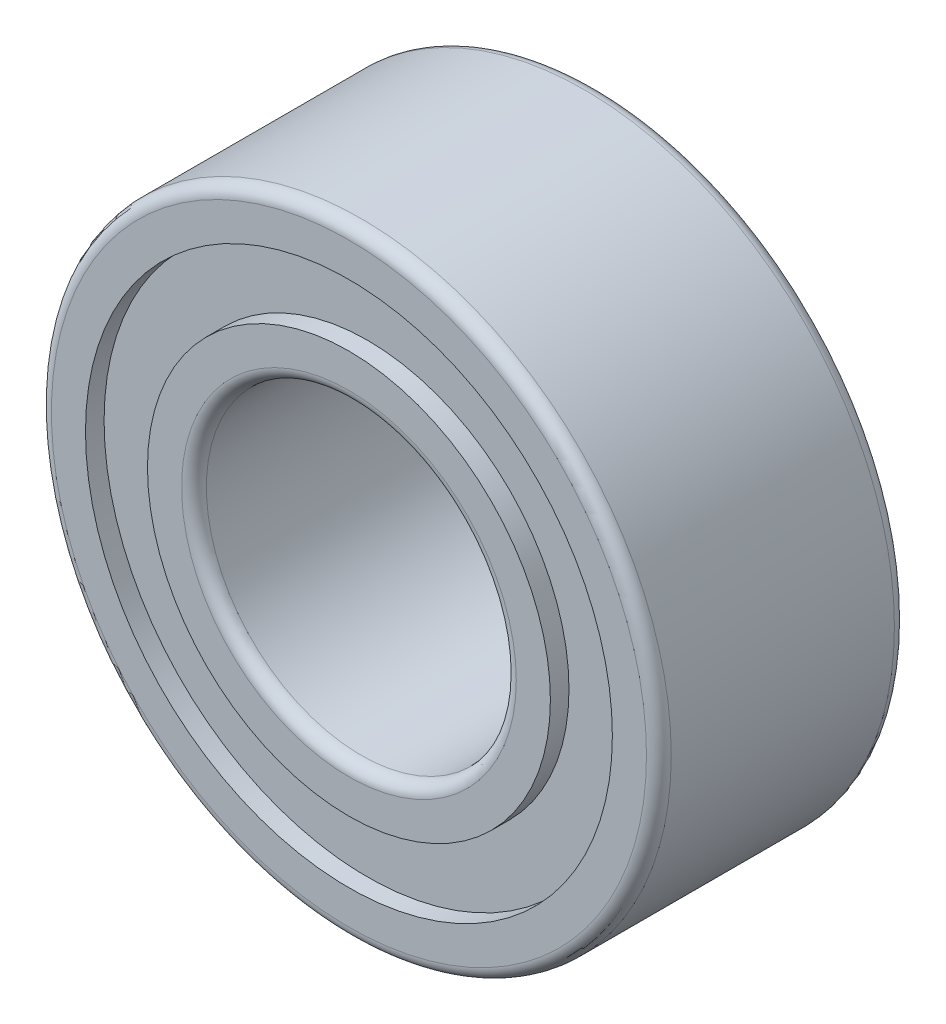
ISO-10303-21;
HEADER;
FILE_DESCRIPTION(('STEP AP214'),'2;1');
FILE_NAME('part.step','',(''),(''),'','','');
FILE_SCHEMA(('AUTOMOTIVE_DESIGN { 1 0 10303 214 1 1 1 1 }'));
ENDSEC;
DATA;
#1=APPLICATION_CONTEXT('core data for automotive mechanical design processes');
#2=APPLICATION_PROTOCOL_DEFINITION('international standard','automotive_design',2000,#1);
#3=PRODUCT_CONTEXT('',#1,'mechanical');
#4=PRODUCT('Part','Part','',(#3));
#5=PRODUCT_RELATED_PRODUCT_CATEGORY('part','',(#4));
#6=PRODUCT_DEFINITION_FORMATION('','',#4);
#7=PRODUCT_DEFINITION_CONTEXT('part definition',#1,'design');
#8=PRODUCT_DEFINITION('design','',#6,#7);
#9=PRODUCT_DEFINITION_SHAPE('','',#8);
#10=(LENGTH_UNIT() NAMED_UNIT(*) SI_UNIT(.MILLI.,.METRE.));
#11=(NAMED_UNIT(*) PLANE_ANGLE_UNIT() SI_UNIT($,.RADIAN.));
#12=(NAMED_UNIT(*) SI_UNIT($,.STERADIAN.) SOLID_ANGLE_UNIT());
#13=UNCERTAINTY_MEASURE_WITH_UNIT(LENGTH_MEASURE(1.E-05),#10,'distance_accuracy_value','');
#14=(GEOMETRIC_REPRESENTATION_CONTEXT(3) GLOBAL_UNCERTAINTY_ASSIGNED_CONTEXT((#13)) GLOBAL_UNIT_ASSIGNED_CONTEXT((#10,
#11,#12)) REPRESENTATION_CONTEXT('',''));
#15=CARTESIAN_POINT('',(0.,0.,0.));
#16=DIRECTION('',(0.,0.,1.));
#17=DIRECTION('',(1.,0.,0.));
#18=AXIS2_PLACEMENT_3D('',#15,#16,#17);
#19=CARTESIAN_POINT('',(0.,0.,0.));
#20=DIRECTION('',(0.,0.,1.));
#21=DIRECTION('',(1.,0.,0.));
#22=AXIS2_PLACEMENT_3D('',#19,#20,#21);
#23=PLANE('',#22);
#24=CARTESIAN_POINT('',(0.,0.,0.));
#25=DIRECTION('',(0.,0.,1.));
#26=DIRECTION('',(1.,0.,0.));
#27=AXIS2_PLACEMENT_3D('',#24,#25,#26);
#28=CIRCLE('',#27,2.7);
#29=CARTESIAN_POINT('',(2.7,0.,0.));
#30=VERTEX_POINT('',#29);
#31=EDGE_CURVE('E10',#30,#30,#28,.T.);
#32=ORIENTED_EDGE('',*,*,#31,.T.);
#33=EDGE_LOOP('',(#32));
#34=FACE_BOUND('',#33,.T.);
#35=CARTESIAN_POINT('',(0.,0.,0.));
#36=DIRECTION('',(0.,0.,-1.));
#37=DIRECTION('',(-1.,0.,0.));
#38=AXIS2_PLACEMENT_3D('',#35,#36,#37);
#39=CIRCLE('',#38,3.25);
#40=CARTESIAN_POINT('',(-3.25,0.,0.));
#41=VERTEX_POINT('',#40);
#42=EDGE_CURVE('E87',#41,#41,#39,.T.);
#43=ORIENTED_EDGE('',*,*,#42,.T.);
#44=EDGE_LOOP('',(#43));
#45=FACE_BOUND('',#44,.T.);
#46=ADVANCED_FACE('F36',(#34,#45),#23,.F.);
#47=CARTESIAN_POINT('',(0.,0.,4.));
#48=DIRECTION('',(0.,0.,1.));
#49=DIRECTION('',(1.,0.,0.));
#50=AXIS2_PLACEMENT_3D('',#47,#48,#49);
#51=PLANE('',#50);
#52=CARTESIAN_POINT('',(0.,0.,4.));
#53=DIRECTION('',(0.,0.,1.));
#54=DIRECTION('',(1.,0.,0.));
#55=AXIS2_PLACEMENT_3D('',#52,#53,#54);
#56=CIRCLE('',#55,2.7);
#57=CARTESIAN_POINT('',(2.7,0.,4.));
#58=VERTEX_POINT('',#57);
#59=EDGE_CURVE('E43',#58,#58,#56,.F.);
#60=ORIENTED_EDGE('',*,*,#59,.T.);
#61=EDGE_LOOP('',(#60));
#62=FACE_BOUND('',#61,.T.);
#63=CARTESIAN_POINT('',(0.,0.,4.));
#64=DIRECTION('',(0.,0.,1.));
#65=DIRECTION('',(1.,0.,0.));
#66=AXIS2_PLACEMENT_3D('',#63,#64,#65);
#67=CIRCLE('',#66,3.25);
#68=CARTESIAN_POINT('',(3.25,0.,4.));
#69=VERTEX_POINT('',#68);
#70=EDGE_CURVE('E73',#69,#69,#67,.T.);
#71=ORIENTED_EDGE('',*,*,#70,.T.);
#72=EDGE_LOOP('',(#71));
#73=FACE_BOUND('',#72,.T.);
#74=ADVANCED_FACE('F125',(#62,#73),#51,.T.);
#75=CARTESIAN_POINT('',(0.,0.,4.));
#76=DIRECTION('',(0.,0.,-1.));
#77=DIRECTION('',(-1.,0.,0.));
#78=AXIS2_PLACEMENT_3D('',#75,#76,#77);
#79=CYLINDRICAL_SURFACE('',#78,2.5);
#80=CARTESIAN_POINT('',(0.,0.,3.8));
#81=DIRECTION('',(0.,0.,1.));
#82=DIRECTION('',(1.,0.,0.));
#83=AXIS2_PLACEMENT_3D('',#80,#81,#82);
#84=CIRCLE('',#83,2.5);
#85=CARTESIAN_POINT('',(2.5,0.,3.8));
#86=VERTEX_POINT('',#85);
#87=EDGE_CURVE('E47',#86,#86,#84,.T.);
#88=ORIENTED_EDGE('',*,*,#87,.T.);
#89=EDGE_LOOP('',(#88));
#90=FACE_BOUND('',#89,.T.);
#91=CARTESIAN_POINT('',(0.,0.,0.2));
#92=DIRECTION('',(0.,0.,1.));
#93=DIRECTION('',(1.,0.,0.));
#94=AXIS2_PLACEMENT_3D('',#91,#92,#93);
#95=CIRCLE('',#94,2.5);
#96=CARTESIAN_POINT('',(2.5,0.,0.2));
#97=VERTEX_POINT('',#96);
#98=EDGE_CURVE('E51',#97,#97,#95,.F.);
#99=ORIENTED_EDGE('',*,*,#98,.T.);
#100=EDGE_LOOP('',(#99));
#101=FACE_BOUND('',#100,.T.);
#102=ADVANCED_FACE('F131',(#90,#101),#79,.F.);
#103=CARTESIAN_POINT('',(0.,0.,4.));
#104=DIRECTION('',(0.,0.,-1.));
#105=DIRECTION('',(-1.,0.,0.));
#106=AXIS2_PLACEMENT_3D('',#103,#104,#105);
#107=CYLINDRICAL_SURFACE('',#106,5.);
#108=CARTESIAN_POINT('',(0.,0.,3.8));
#109=DIRECTION('',(0.,0.,1.));
#110=DIRECTION('',(1.,0.,0.));
#111=AXIS2_PLACEMENT_3D('',#108,#109,#110);
#112=CIRCLE('',#111,5.);
#113=CARTESIAN_POINT('',(5.,0.,3.8));
#114=VERTEX_POINT('',#113);
#115=EDGE_CURVE('E59',#114,#114,#112,.F.);
#116=ORIENTED_EDGE('',*,*,#115,.T.);
#117=EDGE_LOOP('',(#116));
#118=FACE_BOUND('',#117,.T.);
#119=CARTESIAN_POINT('',(0.,0.,0.2));
#120=DIRECTION('',(0.,0.,1.));
#121=DIRECTION('',(1.,0.,0.));
#122=AXIS2_PLACEMENT_3D('',#119,#120,#121);
#123=CIRCLE('',#122,5.);
#124=CARTESIAN_POINT('',(5.,0.,0.2));
#125=VERTEX_POINT('',#124);
#126=EDGE_CURVE('E62',#125,#125,#123,.T.);
#127=ORIENTED_EDGE('',*,*,#126,.T.);
#128=EDGE_LOOP('',(#127));
#129=FACE_BOUND('',#128,.T.);
#130=ADVANCED_FACE('F122',(#118,#129),#107,.T.);
#131=CARTESIAN_POINT('',(0.,0.,4.));
#132=DIRECTION('',(0.,0.,1.));
#133=DIRECTION('',(1.,0.,0.));
#134=AXIS2_PLACEMENT_3D('',#131,#132,#133);
#135=CIRCLE('',#134,4.8);
#136=CARTESIAN_POINT('',(4.8,0.,4.));
#137=VERTEX_POINT('',#136);
#138=EDGE_CURVE('E65',#137,#137,#135,.T.);
#139=ORIENTED_EDGE('',*,*,#138,.T.);
#140=EDGE_LOOP('',(#139));
#141=FACE_BOUND('',#140,.T.);
#142=CARTESIAN_POINT('',(0.,0.,4.));
#143=DIRECTION('',(0.,0.,1.));
#144=DIRECTION('',(1.,0.,0.));
#145=AXIS2_PLACEMENT_3D('',#142,#143,#144);
#146=CIRCLE('',#145,4.25);
#147=CARTESIAN_POINT('',(4.25,0.,4.));
#148=VERTEX_POINT('',#147);
#149=EDGE_CURVE('E69',#148,#148,#146,.T.);
#150=ORIENTED_EDGE('',*,*,#149,.F.);
#151=EDGE_LOOP('',(#150));
#152=FACE_BOUND('',#151,.T.);
#153=ADVANCED_FACE('F112',(#141,#152),#51,.T.);
#154=CARTESIAN_POINT('',(0.,0.,0.));
#155=DIRECTION('',(0.,0.,1.));
#156=DIRECTION('',(1.,0.,0.));
#157=AXIS2_PLACEMENT_3D('',#154,#155,#156);
#158=CIRCLE('',#157,4.8);
#159=CARTESIAN_POINT('',(4.8,0.,0.));
#160=VERTEX_POINT('',#159);
#161=EDGE_CURVE('E56',#160,#160,#158,.F.);
#162=ORIENTED_EDGE('',*,*,#161,.T.);
#163=EDGE_LOOP('',(#162));
#164=FACE_BOUND('',#163,.T.);
#165=CARTESIAN_POINT('',(0.,0.,0.));
#166=DIRECTION('',(0.,0.,-1.));
#167=DIRECTION('',(-1.,0.,0.));
#168=AXIS2_PLACEMENT_3D('',#165,#166,#167);
#169=CIRCLE('',#168,4.25);
#170=CARTESIAN_POINT('',(-4.25,0.,0.));
#171=VERTEX_POINT('',#170);
#172=EDGE_CURVE('E81',#171,#171,#169,.T.);
#173=ORIENTED_EDGE('',*,*,#172,.F.);
#174=EDGE_LOOP('',(#173));
#175=FACE_BOUND('',#174,.T.);
#176=ADVANCED_FACE('F109',(#164,#175),#23,.F.);
#177=CARTESIAN_POINT('',(0.,0.,3.7));
#178=DIRECTION('',(0.,0.,1.));
#179=DIRECTION('',(1.,0.,0.));
#180=AXIS2_PLACEMENT_3D('',#177,#178,#179);
#181=CYLINDRICAL_SURFACE('',#180,3.25);
#182=CARTESIAN_POINT('',(0.,0.,3.7));
#183=DIRECTION('',(0.,0.,1.));
#184=DIRECTION('',(1.,0.,0.));
#185=AXIS2_PLACEMENT_3D('',#182,#183,#184);
#186=CIRCLE('',#185,3.25);
#187=CARTESIAN_POINT('',(3.25,0.,3.7));
#188=VERTEX_POINT('',#187);
#189=EDGE_CURVE('E72',#188,#188,#186,.T.);
#190=ORIENTED_EDGE('',*,*,#189,.T.);
#191=EDGE_LOOP('',(#190));
#192=FACE_BOUND('',#191,.T.);
#193=ORIENTED_EDGE('',*,*,#70,.F.);
#194=EDGE_LOOP('',(#193));
#195=FACE_BOUND('',#194,.T.);
#196=ADVANCED_FACE('F111',(#192,#195),#181,.T.);
#197=CARTESIAN_POINT('',(0.,0.,3.7));
#198=DIRECTION('',(0.,0.,1.));
#199=DIRECTION('',(1.,0.,0.));
#200=AXIS2_PLACEMENT_3D('',#197,#198,#199);
#201=CYLINDRICAL_SURFACE('',#200,4.25);
#202=CARTESIAN_POINT('',(0.,0.,3.7));
#203=DIRECTION('',(0.,0.,1.));
#204=DIRECTION('',(1.,0.,0.));
#205=AXIS2_PLACEMENT_3D('',#202,#203,#204);
#206=CIRCLE('',#205,4.25);
#207=CARTESIAN_POINT('',(4.25,0.,3.7));
#208=VERTEX_POINT('',#207);
#209=EDGE_CURVE('E68',#208,#208,#206,.T.);
#210=ORIENTED_EDGE('',*,*,#209,.F.);
#211=EDGE_LOOP('',(#210));
#212=FACE_BOUND('',#211,.T.);
#213=ORIENTED_EDGE('',*,*,#149,.T.);
#214=EDGE_LOOP('',(#213));
#215=FACE_BOUND('',#214,.T.);
#216=ADVANCED_FACE('F119',(#212,#215),#201,.F.);
#217=CARTESIAN_POINT('',(0.,0.,3.7));
#218=DIRECTION('',(0.,0.,1.));
#219=DIRECTION('',(1.,0.,0.));
#220=AXIS2_PLACEMENT_3D('',#217,#218,#219);
#221=PLANE('',#220);
#222=ORIENTED_EDGE('',*,*,#189,.F.);
#223=EDGE_LOOP('',(#222));
#224=FACE_BOUND('',#223,.T.);
#225=ORIENTED_EDGE('',*,*,#209,.T.);
#226=EDGE_LOOP('',(#225));
#227=FACE_BOUND('',#226,.T.);
#228=ADVANCED_FACE('F105',(#224,#227),#221,.T.);
#229=CARTESIAN_POINT('',(0.,0.,0.3));
#230=DIRECTION('',(0.,0.,-1.));
#231=DIRECTION('',(-1.,0.,0.));
#232=AXIS2_PLACEMENT_3D('',#229,#230,#231);
#233=CYLINDRICAL_SURFACE('',#232,4.25);
#234=CARTESIAN_POINT('',(0.,0.,0.3));
#235=DIRECTION('',(0.,0.,-1.));
#236=DIRECTION('',(-1.,0.,0.));
#237=AXIS2_PLACEMENT_3D('',#234,#235,#236);
#238=CIRCLE('',#237,4.25);
#239=CARTESIAN_POINT('',(-4.25,0.,0.3));
#240=VERTEX_POINT('',#239);
#241=EDGE_CURVE('E76',#240,#240,#238,.T.);
#242=ORIENTED_EDGE('',*,*,#241,.F.);
#243=EDGE_LOOP('',(#242));
#244=FACE_BOUND('',#243,.T.);
#245=ORIENTED_EDGE('',*,*,#172,.T.);
#246=EDGE_LOOP('',(#245));
#247=FACE_BOUND('',#246,.T.);
#248=ADVANCED_FACE('F99',(#244,#247),#233,.F.);
#249=CARTESIAN_POINT('',(0.,0.,0.3));
#250=DIRECTION('',(0.,0.,-1.));
#251=DIRECTION('',(-1.,0.,0.));
#252=AXIS2_PLACEMENT_3D('',#249,#250,#251);
#253=PLANE('',#252);
#254=CARTESIAN_POINT('',(0.,0.,0.3));
#255=DIRECTION('',(0.,0.,-1.));
#256=DIRECTION('',(-1.,0.,0.));
#257=AXIS2_PLACEMENT_3D('',#254,#255,#256);
#258=CIRCLE('',#257,3.25);
#259=CARTESIAN_POINT('',(-3.25,0.,0.3));
#260=VERTEX_POINT('',#259);
#261=EDGE_CURVE('E84',#260,#260,#258,.T.);
#262=ORIENTED_EDGE('',*,*,#261,.F.);
#263=EDGE_LOOP('',(#262));
#264=FACE_BOUND('',#263,.T.);
#265=ORIENTED_EDGE('',*,*,#241,.T.);
#266=EDGE_LOOP('',(#265));
#267=FACE_BOUND('',#266,.T.);
#268=ADVANCED_FACE('F96',(#264,#267),#253,.T.);
#269=CARTESIAN_POINT('',(0.,0.,0.3));
#270=DIRECTION('',(0.,0.,-1.));
#271=DIRECTION('',(-1.,0.,0.));
#272=AXIS2_PLACEMENT_3D('',#269,#270,#271);
#273=CYLINDRICAL_SURFACE('',#272,3.25);
#274=ORIENTED_EDGE('',*,*,#261,.T.);
#275=EDGE_LOOP('',(#274));
#276=FACE_BOUND('',#275,.T.);
#277=ORIENTED_EDGE('',*,*,#42,.F.);
#278=EDGE_LOOP('',(#277));
#279=FACE_BOUND('',#278,.T.);
#280=ADVANCED_FACE('F93',(#276,#279),#273,.T.);
#281=CARTESIAN_POINT('',(0.,0.,3.8));
#282=DIRECTION('',(0.,0.,1.));
#283=DIRECTION('',(1.,0.,0.));
#284=AXIS2_PLACEMENT_3D('',#281,#282,#283);
#285=TOROIDAL_SURFACE('',#284,4.8,0.2);
#286=ORIENTED_EDGE('',*,*,#115,.F.);
#287=EDGE_LOOP('',(#286));
#288=FACE_BOUND('',#287,.T.);
#289=ORIENTED_EDGE('',*,*,#138,.F.);
#290=EDGE_LOOP('',(#289));
#291=FACE_BOUND('',#290,.T.);
#292=ADVANCED_FACE('F135',(#288,#291),#285,.T.);
#293=CARTESIAN_POINT('',(0.,0.,0.2));
#294=DIRECTION('',(0.,0.,1.));
#295=DIRECTION('',(1.,0.,0.));
#296=AXIS2_PLACEMENT_3D('',#293,#294,#295);
#297=TOROIDAL_SURFACE('',#296,4.8,0.2);
#298=ORIENTED_EDGE('',*,*,#161,.F.);
#299=EDGE_LOOP('',(#298));
#300=FACE_BOUND('',#299,.T.);
#301=ORIENTED_EDGE('',*,*,#126,.F.);
#302=EDGE_LOOP('',(#301));
#303=FACE_BOUND('',#302,.T.);
#304=ADVANCED_FACE('F140',(#300,#303),#297,.T.);
#305=CARTESIAN_POINT('',(0.,0.,3.8));
#306=DIRECTION('',(0.,0.,1.));
#307=DIRECTION('',(1.,0.,0.));
#308=AXIS2_PLACEMENT_3D('',#305,#306,#307);
#309=TOROIDAL_SURFACE('',#308,2.7,0.2);
#310=ORIENTED_EDGE('',*,*,#59,.F.);
#311=EDGE_LOOP('',(#310));
#312=FACE_BOUND('',#311,.T.);
#313=ORIENTED_EDGE('',*,*,#87,.F.);
#314=EDGE_LOOP('',(#313));
#315=FACE_BOUND('',#314,.T.);
#316=ADVANCED_FACE('F233',(#312,#315),#309,.T.);
#317=CARTESIAN_POINT('',(0.,0.,0.2));
#318=DIRECTION('',(0.,0.,1.));
#319=DIRECTION('',(1.,0.,0.));
#320=AXIS2_PLACEMENT_3D('',#317,#318,#319);
#321=TOROIDAL_SURFACE('',#320,2.7,0.2);
#322=ORIENTED_EDGE('',*,*,#98,.F.);
#323=EDGE_LOOP('',(#322));
#324=FACE_BOUND('',#323,.T.);
#325=ORIENTED_EDGE('',*,*,#31,.F.);
#326=EDGE_LOOP('',(#325));
#327=FACE_BOUND('',#326,.T.);
#328=ADVANCED_FACE('F38',(#324,#327),#321,.T.);
#329=CLOSED_SHELL('',(#46,#74,#102,#130,#153,#176,#196,#216,#228,#248,#268,#280,#292,#304,#316,#328));
#330=MANIFOLD_SOLID_BREP('B2',#329);
#331=ADVANCED_BREP_SHAPE_REPRESENTATION('',(#18,#330),#14);
#332=SHAPE_DEFINITION_REPRESENTATION(#9,#331);
ENDSEC;
END-ISO-10303-21;
